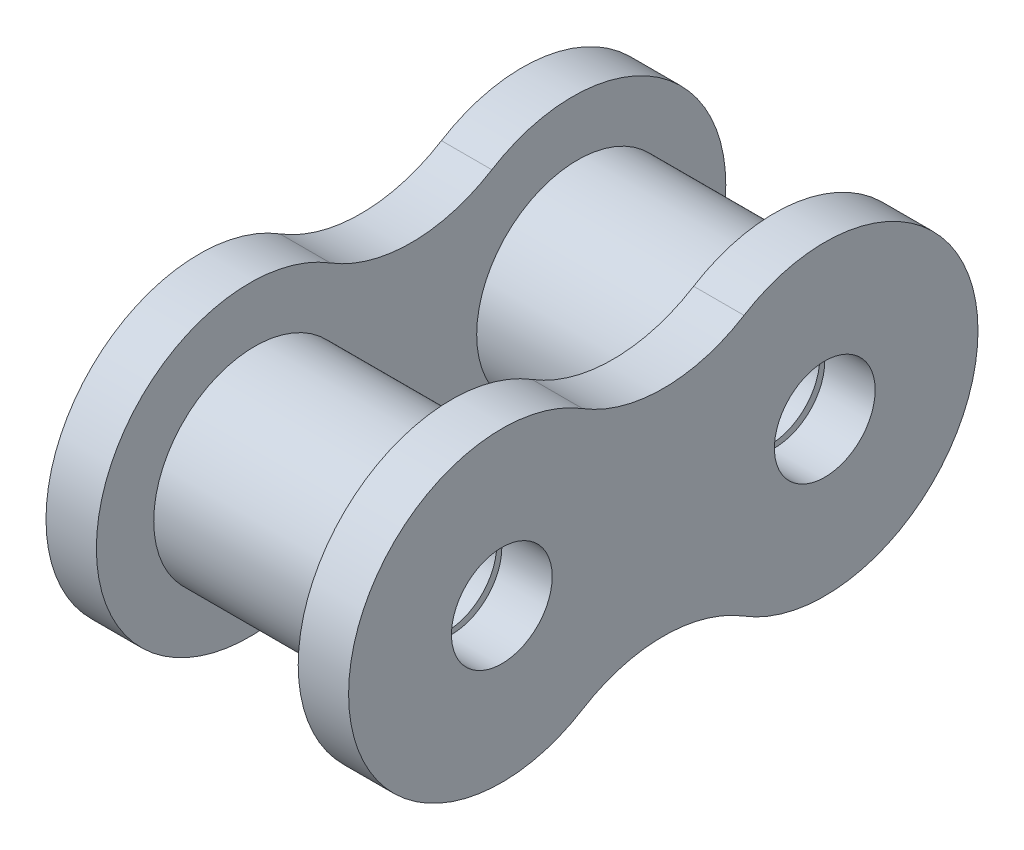
ISO-10303-21;
HEADER;
FILE_DESCRIPTION(('STEP AP214'),'2;1');
FILE_NAME('part.step','',(''),(''),'','','');
FILE_SCHEMA(('AUTOMOTIVE_DESIGN { 1 0 10303 214 1 1 1 1 }'));
ENDSEC;
DATA;
#1=APPLICATION_CONTEXT('core data for automotive mechanical design processes');
#2=APPLICATION_PROTOCOL_DEFINITION('international standard','automotive_design',2000,#1);
#3=PRODUCT_CONTEXT('',#1,'mechanical');
#4=PRODUCT('Part','Part','',(#3));
#5=PRODUCT_RELATED_PRODUCT_CATEGORY('part','',(#4));
#6=PRODUCT_DEFINITION_FORMATION('','',#4);
#7=PRODUCT_DEFINITION_CONTEXT('part definition',#1,'design');
#8=PRODUCT_DEFINITION('design','',#6,#7);
#9=PRODUCT_DEFINITION_SHAPE('','',#8);
#10=(LENGTH_UNIT() NAMED_UNIT(*) SI_UNIT(.MILLI.,.METRE.));
#11=(NAMED_UNIT(*) PLANE_ANGLE_UNIT() SI_UNIT($,.RADIAN.));
#12=(NAMED_UNIT(*) SI_UNIT($,.STERADIAN.) SOLID_ANGLE_UNIT());
#13=UNCERTAINTY_MEASURE_WITH_UNIT(LENGTH_MEASURE(1.E-05),#10,'distance_accuracy_value','');
#14=(GEOMETRIC_REPRESENTATION_CONTEXT(3) GLOBAL_UNCERTAINTY_ASSIGNED_CONTEXT((#13)) GLOBAL_UNIT_ASSIGNED_CONTEXT((#10,
#11,#12)) REPRESENTATION_CONTEXT('',''));
#15=CARTESIAN_POINT('',(0.,0.,0.));
#16=DIRECTION('',(0.,0.,1.));
#17=DIRECTION('',(1.,0.,0.));
#18=AXIS2_PLACEMENT_3D('',#15,#16,#17);
#19=CARTESIAN_POINT('',(-7.540625,0.,12.7));
#20=DIRECTION('',(1.,0.,0.));
#21=DIRECTION('',(0.,0.,-1.));
#22=AXIS2_PLACEMENT_3D('',#19,#20,#21);
#23=CYLINDRICAL_SURFACE('',#22,7.9375);
#24=CARTESIAN_POINT('',(-7.540625,0.,12.7));
#25=DIRECTION('',(1.,0.,0.));
#26=DIRECTION('',(0.,0.,-1.));
#27=AXIS2_PLACEMENT_3D('',#24,#25,#26);
#28=CIRCLE('',#27,7.9375);
#29=CARTESIAN_POINT('',(-7.540625,0.,4.7625));
#30=VERTEX_POINT('',#29);
#31=EDGE_CURVE('E11',#30,#30,#28,.T.);
#32=ORIENTED_EDGE('',*,*,#31,.T.);
#33=EDGE_LOOP('',(#32));
#34=FACE_BOUND('',#33,.T.);
#35=CARTESIAN_POINT('',(7.540625,0.,12.7));
#36=DIRECTION('',(1.,0.,0.));
#37=DIRECTION('',(0.,0.,-1.));
#38=AXIS2_PLACEMENT_3D('',#35,#36,#37);
#39=CIRCLE('',#38,7.9375);
#40=CARTESIAN_POINT('',(7.540625,0.,4.7625));
#41=VERTEX_POINT('',#40);
#42=EDGE_CURVE('E59',#41,#41,#39,.T.);
#43=ORIENTED_EDGE('',*,*,#42,.F.);
#44=EDGE_LOOP('',(#43));
#45=FACE_BOUND('',#44,.T.);
#46=ADVANCED_FACE('F49',(#34,#45),#23,.T.);
#47=CARTESIAN_POINT('',(-7.540625,0.,12.7));
#48=DIRECTION('',(1.,0.,0.));
#49=DIRECTION('',(0.,0.,-1.));
#50=AXIS2_PLACEMENT_3D('',#47,#48,#49);
#51=PLANE('',#50);
#52=CARTESIAN_POINT('',(-7.540625,0.,12.7));
#53=DIRECTION('',(1.,0.,0.));
#54=DIRECTION('',(0.,0.,-1.));
#55=AXIS2_PLACEMENT_3D('',#52,#53,#54);
#56=CIRCLE('',#55,3.9624);
#57=CARTESIAN_POINT('',(-7.540625,0.,8.7376));
#58=VERTEX_POINT('',#57);
#59=EDGE_CURVE('E55',#58,#58,#56,.T.);
#60=ORIENTED_EDGE('',*,*,#59,.T.);
#61=EDGE_LOOP('',(#60));
#62=FACE_BOUND('',#61,.T.);
#63=ORIENTED_EDGE('',*,*,#31,.F.);
#64=EDGE_LOOP('',(#63));
#65=FACE_BOUND('',#64,.T.);
#66=ADVANCED_FACE('F80',(#62,#65),#51,.F.);
#67=CARTESIAN_POINT('',(-7.540625,0.,12.7));
#68=DIRECTION('',(1.,0.,0.));
#69=DIRECTION('',(0.,0.,-1.));
#70=AXIS2_PLACEMENT_3D('',#67,#68,#69);
#71=CYLINDRICAL_SURFACE('',#70,3.9624);
#72=ORIENTED_EDGE('',*,*,#59,.F.);
#73=EDGE_LOOP('',(#72));
#74=FACE_BOUND('',#73,.T.);
#75=CARTESIAN_POINT('',(7.540625,0.,12.7));
#76=DIRECTION('',(1.,0.,0.));
#77=DIRECTION('',(0.,0.,-1.));
#78=AXIS2_PLACEMENT_3D('',#75,#76,#77);
#79=CIRCLE('',#78,3.9624);
#80=CARTESIAN_POINT('',(7.540625,0.,8.7376));
#81=VERTEX_POINT('',#80);
#82=EDGE_CURVE('E64',#81,#81,#79,.T.);
#83=ORIENTED_EDGE('',*,*,#82,.T.);
#84=EDGE_LOOP('',(#83));
#85=FACE_BOUND('',#84,.T.);
#86=ADVANCED_FACE('F71',(#74,#85),#71,.F.);
#87=CARTESIAN_POINT('',(7.540625,0.,12.7));
#88=DIRECTION('',(1.,0.,0.));
#89=DIRECTION('',(0.,0.,-1.));
#90=AXIS2_PLACEMENT_3D('',#87,#88,#89);
#91=PLANE('',#90);
#92=ORIENTED_EDGE('',*,*,#42,.T.);
#93=EDGE_LOOP('',(#92));
#94=FACE_BOUND('',#93,.T.);
#95=ORIENTED_EDGE('',*,*,#82,.F.);
#96=EDGE_LOOP('',(#95));
#97=FACE_BOUND('',#96,.T.);
#98=ADVANCED_FACE('F73',(#94,#97),#91,.T.);
#99=CLOSED_SHELL('',(#46,#66,#86,#98));
#100=MANIFOLD_SOLID_BREP('B2',#99);
#101=CARTESIAN_POINT('',(-7.540625,0.,-12.7));
#102=DIRECTION('',(1.,0.,0.));
#103=DIRECTION('',(0.,0.,-1.));
#104=AXIS2_PLACEMENT_3D('',#101,#102,#103);
#105=CYLINDRICAL_SURFACE('',#104,7.9375);
#106=CARTESIAN_POINT('',(-7.540625,0.,-12.7));
#107=DIRECTION('',(1.,0.,0.));
#108=DIRECTION('',(0.,0.,-1.));
#109=AXIS2_PLACEMENT_3D('',#106,#107,#108);
#110=CIRCLE('',#109,7.9375);
#111=CARTESIAN_POINT('',(-7.540625,0.,-20.6375));
#112=VERTEX_POINT('',#111);
#113=EDGE_CURVE('E48',#112,#112,#110,.T.);
#114=ORIENTED_EDGE('',*,*,#113,.T.);
#115=EDGE_LOOP('',(#114));
#116=FACE_BOUND('',#115,.T.);
#117=CARTESIAN_POINT('',(7.540625,0.,-12.7));
#118=DIRECTION('',(1.,0.,0.));
#119=DIRECTION('',(0.,0.,-1.));
#120=AXIS2_PLACEMENT_3D('',#117,#118,#119);
#121=CIRCLE('',#120,7.9375);
#122=CARTESIAN_POINT('',(7.540625,0.,-20.6375));
#123=VERTEX_POINT('',#122);
#124=EDGE_CURVE('E133',#123,#123,#121,.T.);
#125=ORIENTED_EDGE('',*,*,#124,.F.);
#126=EDGE_LOOP('',(#125));
#127=FACE_BOUND('',#126,.T.);
#128=ADVANCED_FACE('F122',(#116,#127),#105,.T.);
#129=CARTESIAN_POINT('',(-7.540625,0.,-12.7));
#130=DIRECTION('',(1.,0.,0.));
#131=DIRECTION('',(0.,0.,-1.));
#132=AXIS2_PLACEMENT_3D('',#129,#130,#131);
#133=PLANE('',#132);
#134=CARTESIAN_POINT('',(-7.540625,0.,-12.7));
#135=DIRECTION('',(1.,0.,0.));
#136=DIRECTION('',(0.,0.,-1.));
#137=AXIS2_PLACEMENT_3D('',#134,#135,#136);
#138=CIRCLE('',#137,3.9624);
#139=CARTESIAN_POINT('',(-7.540625,0.,-16.6624));
#140=VERTEX_POINT('',#139);
#141=EDGE_CURVE('E129',#140,#140,#138,.T.);
#142=ORIENTED_EDGE('',*,*,#141,.T.);
#143=EDGE_LOOP('',(#142));
#144=FACE_BOUND('',#143,.T.);
#145=ORIENTED_EDGE('',*,*,#113,.F.);
#146=EDGE_LOOP('',(#145));
#147=FACE_BOUND('',#146,.T.);
#148=ADVANCED_FACE('F152',(#144,#147),#133,.F.);
#149=CARTESIAN_POINT('',(-7.540625,0.,-12.7));
#150=DIRECTION('',(1.,0.,0.));
#151=DIRECTION('',(0.,0.,-1.));
#152=AXIS2_PLACEMENT_3D('',#149,#150,#151);
#153=CYLINDRICAL_SURFACE('',#152,3.9624);
#154=ORIENTED_EDGE('',*,*,#141,.F.);
#155=EDGE_LOOP('',(#154));
#156=FACE_BOUND('',#155,.T.);
#157=CARTESIAN_POINT('',(7.540625,0.,-12.7));
#158=DIRECTION('',(1.,0.,0.));
#159=DIRECTION('',(0.,0.,-1.));
#160=AXIS2_PLACEMENT_3D('',#157,#158,#159);
#161=CIRCLE('',#160,3.9624);
#162=CARTESIAN_POINT('',(7.540625,0.,-16.6624));
#163=VERTEX_POINT('',#162);
#164=EDGE_CURVE('E137',#163,#163,#161,.T.);
#165=ORIENTED_EDGE('',*,*,#164,.T.);
#166=EDGE_LOOP('',(#165));
#167=FACE_BOUND('',#166,.T.);
#168=ADVANCED_FACE('F143',(#156,#167),#153,.F.);
#169=CARTESIAN_POINT('',(7.540625,0.,-12.7));
#170=DIRECTION('',(1.,0.,0.));
#171=DIRECTION('',(0.,0.,-1.));
#172=AXIS2_PLACEMENT_3D('',#169,#170,#171);
#173=PLANE('',#172);
#174=ORIENTED_EDGE('',*,*,#124,.T.);
#175=EDGE_LOOP('',(#174));
#176=FACE_BOUND('',#175,.T.);
#177=ORIENTED_EDGE('',*,*,#164,.F.);
#178=EDGE_LOOP('',(#177));
#179=FACE_BOUND('',#178,.T.);
#180=ADVANCED_FACE('F145',(#176,#179),#173,.T.);
#181=CLOSED_SHELL('',(#128,#148,#168,#180));
#182=MANIFOLD_SOLID_BREP('B6',#181);
#183=CARTESIAN_POINT('',(11.8999,-10.2437998462485,6.35));
#184=DIRECTION('',(1.,0.,0.));
#185=DIRECTION('',(0.,0.,-1.));
#186=AXIS2_PLACEMENT_3D('',#183,#184,#185);
#187=PLANE('',#186);
#188=CARTESIAN_POINT('',(11.8999,0.,12.7));
#189=DIRECTION('',(1.,0.,0.));
#190=DIRECTION('',(0.,0.,-1.));
#191=AXIS2_PLACEMENT_3D('',#188,#189,#190);
#192=CIRCLE('',#191,3.9624);
#193=CARTESIAN_POINT('',(11.8999,0.,8.7376));
#194=VERTEX_POINT('',#193);
#195=EDGE_CURVE('E263',#194,#194,#192,.T.);
#196=ORIENTED_EDGE('',*,*,#195,.F.);
#197=EDGE_LOOP('',(#196));
#198=FACE_BOUND('',#197,.T.);
#199=CARTESIAN_POINT('',(11.8999,0.,12.7));
#200=DIRECTION('',(1.,0.,0.));
#201=DIRECTION('',(0.,0.,-1.));
#202=AXIS2_PLACEMENT_3D('',#199,#200,#201);
#203=CIRCLE('',#202,12.0523);
#204=CARTESIAN_POINT('',(11.8999,10.2437998462485,6.35000000000001));
#205=VERTEX_POINT('',#204);
#206=CARTESIAN_POINT('',(11.8999,-10.2437998462485,6.35));
#207=VERTEX_POINT('',#206);
#208=EDGE_CURVE('E247',#205,#207,#203,.T.);
#209=ORIENTED_EDGE('',*,*,#208,.T.);
#210=CARTESIAN_POINT('',(11.8999,-20.4875996924969,0.));
#211=DIRECTION('',(-1.,0.,0.));
#212=DIRECTION('',(0.,0.,-1.));
#213=AXIS2_PLACEMENT_3D('',#210,#211,#212);
#214=CIRCLE('',#213,12.0523);
#215=CARTESIAN_POINT('',(11.8999,-10.2437998462485,-6.34999999999999));
#216=VERTEX_POINT('',#215);
#217=EDGE_CURVE('E242',#207,#216,#214,.T.);
#218=ORIENTED_EDGE('',*,*,#217,.T.);
#219=CARTESIAN_POINT('',(11.8999,0.,-12.7));
#220=DIRECTION('',(1.,0.,0.));
#221=DIRECTION('',(0.,0.,-1.));
#222=AXIS2_PLACEMENT_3D('',#219,#220,#221);
#223=CIRCLE('',#222,12.0523);
#224=CARTESIAN_POINT('',(11.8999,10.2437998462484,-6.34999999999999));
#225=VERTEX_POINT('',#224);
#226=EDGE_CURVE('E245',#216,#225,#223,.T.);
#227=ORIENTED_EDGE('',*,*,#226,.T.);
#228=CARTESIAN_POINT('',(11.8999,20.4875996924969,0.));
#229=DIRECTION('',(-1.,0.,0.));
#230=DIRECTION('',(0.,0.,-1.));
#231=AXIS2_PLACEMENT_3D('',#228,#229,#230);
#232=CIRCLE('',#231,12.0523);
#233=EDGE_CURVE('E211',#225,#205,#232,.T.);
#234=ORIENTED_EDGE('',*,*,#233,.T.);
#235=EDGE_LOOP('',(#209,#218,#227,#234));
#236=FACE_BOUND('',#235,.T.);
#237=CARTESIAN_POINT('',(11.8999,0.,-12.7));
#238=DIRECTION('',(1.,0.,0.));
#239=DIRECTION('',(0.,0.,-1.));
#240=AXIS2_PLACEMENT_3D('',#237,#238,#239);
#241=CIRCLE('',#240,3.9624);
#242=CARTESIAN_POINT('',(11.8999,0.,-16.6624));
#243=VERTEX_POINT('',#242);
#244=EDGE_CURVE('E280',#243,#243,#241,.T.);
#245=ORIENTED_EDGE('',*,*,#244,.F.);
#246=EDGE_LOOP('',(#245));
#247=FACE_BOUND('',#246,.T.);
#248=ADVANCED_FACE('F193',(#198,#236,#247),#187,.T.);
#249=CARTESIAN_POINT('',(7.9375,-10.2437998462485,6.35));
#250=DIRECTION('',(1.,0.,0.));
#251=DIRECTION('',(0.,0.,-1.));
#252=AXIS2_PLACEMENT_3D('',#249,#250,#251);
#253=PLANE('',#252);
#254=CARTESIAN_POINT('',(7.9375,0.,12.7));
#255=DIRECTION('',(1.,0.,0.));
#256=DIRECTION('',(0.,0.,-1.));
#257=AXIS2_PLACEMENT_3D('',#254,#255,#256);
#258=CIRCLE('',#257,3.9624);
#259=CARTESIAN_POINT('',(7.9375,0.,8.7376));
#260=VERTEX_POINT('',#259);
#261=EDGE_CURVE('E276',#260,#260,#258,.T.);
#262=ORIENTED_EDGE('',*,*,#261,.T.);
#263=EDGE_LOOP('',(#262));
#264=FACE_BOUND('',#263,.T.);
#265=CARTESIAN_POINT('',(7.9375,0.,12.7));
#266=DIRECTION('',(1.,0.,0.));
#267=DIRECTION('',(0.,0.,-1.));
#268=AXIS2_PLACEMENT_3D('',#265,#266,#267);
#269=CIRCLE('',#268,12.0523);
#270=CARTESIAN_POINT('',(7.9375,10.2437998462485,6.35000000000001));
#271=VERTEX_POINT('',#270);
#272=CARTESIAN_POINT('',(7.9375,-10.2437998462485,6.35));
#273=VERTEX_POINT('',#272);
#274=EDGE_CURVE('E259',#271,#273,#269,.T.);
#275=ORIENTED_EDGE('',*,*,#274,.F.);
#276=CARTESIAN_POINT('',(7.9375,20.4875996924969,0.));
#277=DIRECTION('',(-1.,0.,0.));
#278=DIRECTION('',(0.,0.,-1.));
#279=AXIS2_PLACEMENT_3D('',#276,#277,#278);
#280=CIRCLE('',#279,12.0523);
#281=CARTESIAN_POINT('',(7.9375,10.2437998462484,-6.34999999999999));
#282=VERTEX_POINT('',#281);
#283=EDGE_CURVE('E235',#282,#271,#280,.T.);
#284=ORIENTED_EDGE('',*,*,#283,.F.);
#285=CARTESIAN_POINT('',(7.9375,0.,-12.7));
#286=DIRECTION('',(1.,0.,0.));
#287=DIRECTION('',(0.,0.,-1.));
#288=AXIS2_PLACEMENT_3D('',#285,#286,#287);
#289=CIRCLE('',#288,12.0523);
#290=CARTESIAN_POINT('',(7.9375,-10.2437998462485,-6.34999999999999));
#291=VERTEX_POINT('',#290);
#292=EDGE_CURVE('E229',#291,#282,#289,.T.);
#293=ORIENTED_EDGE('',*,*,#292,.F.);
#294=CARTESIAN_POINT('',(7.9375,-20.4875996924969,0.));
#295=DIRECTION('',(-1.,0.,0.));
#296=DIRECTION('',(0.,0.,-1.));
#297=AXIS2_PLACEMENT_3D('',#294,#295,#296);
#298=CIRCLE('',#297,12.0523);
#299=EDGE_CURVE('E251',#273,#291,#298,.T.);
#300=ORIENTED_EDGE('',*,*,#299,.F.);
#301=EDGE_LOOP('',(#275,#284,#293,#300));
#302=FACE_BOUND('',#301,.T.);
#303=CARTESIAN_POINT('',(7.9375,0.,-12.7));
#304=DIRECTION('',(1.,0.,0.));
#305=DIRECTION('',(0.,0.,-1.));
#306=AXIS2_PLACEMENT_3D('',#303,#304,#305);
#307=CIRCLE('',#306,3.9624);
#308=CARTESIAN_POINT('',(7.9375,0.,-16.6624));
#309=VERTEX_POINT('',#308);
#310=EDGE_CURVE('E284',#309,#309,#307,.T.);
#311=ORIENTED_EDGE('',*,*,#310,.T.);
#312=EDGE_LOOP('',(#311));
#313=FACE_BOUND('',#312,.T.);
#314=ADVANCED_FACE('F272',(#264,#302,#313),#253,.F.);
#315=CARTESIAN_POINT('',(11.8999,0.,12.7));
#316=DIRECTION('',(-1.,0.,0.));
#317=DIRECTION('',(0.,0.,1.));
#318=AXIS2_PLACEMENT_3D('',#315,#316,#317);
#319=CYLINDRICAL_SURFACE('',#318,12.0523);
#320=ORIENTED_EDGE('',*,*,#274,.T.);
#321=DIRECTION('',(-1.,0.,0.));
#322=VECTOR('',#321,1.);
#323=CARTESIAN_POINT('',(11.8999,-10.2437998462485,6.35));
#324=LINE('',#323,#322);
#325=EDGE_CURVE('E120',#207,#273,#324,.T.);
#326=ORIENTED_EDGE('',*,*,#325,.F.);
#327=ORIENTED_EDGE('',*,*,#208,.F.);
#328=DIRECTION('',(-1.,0.,0.));
#329=VECTOR('',#328,1.);
#330=CARTESIAN_POINT('',(11.8999,10.2437998462485,6.35000000000001));
#331=LINE('',#330,#329);
#332=EDGE_CURVE('E255',#205,#271,#331,.T.);
#333=ORIENTED_EDGE('',*,*,#332,.T.);
#334=EDGE_LOOP('',(#320,#326,#327,#333));
#335=FACE_BOUND('',#334,.T.);
#336=ADVANCED_FACE('F195',(#335),#319,.T.);
#337=CARTESIAN_POINT('',(11.8999,-20.4875996924969,0.));
#338=DIRECTION('',(-1.,0.,0.));
#339=DIRECTION('',(0.,0.,1.));
#340=AXIS2_PLACEMENT_3D('',#337,#338,#339);
#341=CYLINDRICAL_SURFACE('',#340,12.0523);
#342=ORIENTED_EDGE('',*,*,#299,.T.);
#343=DIRECTION('',(-1.,0.,0.));
#344=VECTOR('',#343,1.);
#345=CARTESIAN_POINT('',(11.8999,-10.2437998462485,-6.34999999999999));
#346=LINE('',#345,#344);
#347=EDGE_CURVE('E203',#216,#291,#346,.T.);
#348=ORIENTED_EDGE('',*,*,#347,.F.);
#349=ORIENTED_EDGE('',*,*,#217,.F.);
#350=ORIENTED_EDGE('',*,*,#325,.T.);
#351=EDGE_LOOP('',(#342,#348,#349,#350));
#352=FACE_BOUND('',#351,.T.);
#353=ADVANCED_FACE('F250',(#352),#341,.F.);
#354=CARTESIAN_POINT('',(11.8999,0.,-12.7));
#355=DIRECTION('',(-1.,0.,0.));
#356=DIRECTION('',(0.,0.,1.));
#357=AXIS2_PLACEMENT_3D('',#354,#355,#356);
#358=CYLINDRICAL_SURFACE('',#357,12.0523);
#359=ORIENTED_EDGE('',*,*,#292,.T.);
#360=DIRECTION('',(-1.,0.,0.));
#361=VECTOR('',#360,1.);
#362=CARTESIAN_POINT('',(11.8999,10.2437998462484,-6.34999999999999));
#363=LINE('',#362,#361);
#364=EDGE_CURVE('E252',#225,#282,#363,.T.);
#365=ORIENTED_EDGE('',*,*,#364,.F.);
#366=ORIENTED_EDGE('',*,*,#226,.F.);
#367=ORIENTED_EDGE('',*,*,#347,.T.);
#368=EDGE_LOOP('',(#359,#365,#366,#367));
#369=FACE_BOUND('',#368,.T.);
#370=ADVANCED_FACE('F253',(#369),#358,.T.);
#371=CARTESIAN_POINT('',(11.8999,20.4875996924969,0.));
#372=DIRECTION('',(-1.,0.,0.));
#373=DIRECTION('',(0.,0.,1.));
#374=AXIS2_PLACEMENT_3D('',#371,#372,#373);
#375=CYLINDRICAL_SURFACE('',#374,12.0523);
#376=ORIENTED_EDGE('',*,*,#283,.T.);
#377=ORIENTED_EDGE('',*,*,#332,.F.);
#378=ORIENTED_EDGE('',*,*,#233,.F.);
#379=ORIENTED_EDGE('',*,*,#364,.T.);
#380=EDGE_LOOP('',(#376,#377,#378,#379));
#381=FACE_BOUND('',#380,.T.);
#382=ADVANCED_FACE('F269',(#381),#375,.F.);
#383=CARTESIAN_POINT('',(11.8999,0.,12.7));
#384=DIRECTION('',(-1.,0.,0.));
#385=DIRECTION('',(0.,0.,1.));
#386=AXIS2_PLACEMENT_3D('',#383,#384,#385);
#387=CYLINDRICAL_SURFACE('',#386,3.9624);
#388=ORIENTED_EDGE('',*,*,#195,.T.);
#389=EDGE_LOOP('',(#388));
#390=FACE_BOUND('',#389,.T.);
#391=ORIENTED_EDGE('',*,*,#261,.F.);
#392=EDGE_LOOP('',(#391));
#393=FACE_BOUND('',#392,.T.);
#394=ADVANCED_FACE('F302',(#390,#393),#387,.F.);
#395=CARTESIAN_POINT('',(11.8999,0.,-12.7));
#396=DIRECTION('',(-1.,0.,0.));
#397=DIRECTION('',(0.,0.,1.));
#398=AXIS2_PLACEMENT_3D('',#395,#396,#397);
#399=CYLINDRICAL_SURFACE('',#398,3.9624);
#400=ORIENTED_EDGE('',*,*,#244,.T.);
#401=EDGE_LOOP('',(#400));
#402=FACE_BOUND('',#401,.T.);
#403=ORIENTED_EDGE('',*,*,#310,.F.);
#404=EDGE_LOOP('',(#403));
#405=FACE_BOUND('',#404,.T.);
#406=ADVANCED_FACE('F290',(#402,#405),#399,.F.);
#407=CLOSED_SHELL('',(#248,#314,#336,#353,#370,#382,#394,#406));
#408=MANIFOLD_SOLID_BREP('B43',#407);
#409=CARTESIAN_POINT('',(-11.8999,20.4875996924969,0.));
#410=DIRECTION('',(1.,0.,0.));
#411=DIRECTION('',(0.,0.,-1.));
#412=AXIS2_PLACEMENT_3D('',#409,#410,#411);
#413=CYLINDRICAL_SURFACE('',#412,12.0523);
#414=CARTESIAN_POINT('',(-7.9375,20.4875996924969,0.));
#415=DIRECTION('',(-1.,0.,0.));
#416=DIRECTION('',(0.,0.,1.));
#417=AXIS2_PLACEMENT_3D('',#414,#415,#416);
#418=CIRCLE('',#417,12.0523);
#419=CARTESIAN_POINT('',(-7.9375,10.2437998462484,-6.34999999999999));
#420=VERTEX_POINT('',#419);
#421=CARTESIAN_POINT('',(-7.9375,10.2437998462485,6.35));
#422=VERTEX_POINT('',#421);
#423=EDGE_CURVE('E433',#420,#422,#418,.T.);
#424=ORIENTED_EDGE('',*,*,#423,.F.);
#425=DIRECTION('',(1.,0.,0.));
#426=VECTOR('',#425,1.);
#427=CARTESIAN_POINT('',(-11.8999,10.2437998462484,-6.34999999999999));
#428=LINE('',#427,#426);
#429=CARTESIAN_POINT('',(-11.8999,10.2437998462484,-6.34999999999999));
#430=VERTEX_POINT('',#429);
#431=EDGE_CURVE('E191',#430,#420,#428,.T.);
#432=ORIENTED_EDGE('',*,*,#431,.F.);
#433=CARTESIAN_POINT('',(-11.8999,20.4875996924969,0.));
#434=DIRECTION('',(-1.,0.,0.));
#435=DIRECTION('',(0.,0.,1.));
#436=AXIS2_PLACEMENT_3D('',#433,#434,#435);
#437=CIRCLE('',#436,12.0523);
#438=CARTESIAN_POINT('',(-11.8999,10.2437998462485,6.35));
#439=VERTEX_POINT('',#438);
#440=EDGE_CURVE('E425',#430,#439,#437,.T.);
#441=ORIENTED_EDGE('',*,*,#440,.T.);
#442=DIRECTION('',(1.,0.,0.));
#443=VECTOR('',#442,1.);
#444=CARTESIAN_POINT('',(-11.8999,10.2437998462485,6.35));
#445=LINE('',#444,#443);
#446=EDGE_CURVE('E369',#439,#422,#445,.T.);
#447=ORIENTED_EDGE('',*,*,#446,.T.);
#448=EDGE_LOOP('',(#424,#432,#441,#447));
#449=FACE_BOUND('',#448,.T.);
#450=ADVANCED_FACE('F366',(#449),#413,.F.);
#451=CARTESIAN_POINT('',(-11.8999,0.,-12.7));
#452=DIRECTION('',(1.,0.,0.));
#453=DIRECTION('',(0.,0.,-1.));
#454=AXIS2_PLACEMENT_3D('',#451,#452,#453);
#455=CYLINDRICAL_SURFACE('',#454,12.0523);
#456=CARTESIAN_POINT('',(-7.9375,0.,-12.7));
#457=DIRECTION('',(1.,0.,0.));
#458=DIRECTION('',(0.,0.,-1.));
#459=AXIS2_PLACEMENT_3D('',#456,#457,#458);
#460=CIRCLE('',#459,12.0523);
#461=CARTESIAN_POINT('',(-7.9375,-10.2437998462485,-6.35));
#462=VERTEX_POINT('',#461);
#463=EDGE_CURVE('E427',#462,#420,#460,.T.);
#464=ORIENTED_EDGE('',*,*,#463,.F.);
#465=DIRECTION('',(1.,0.,0.));
#466=VECTOR('',#465,1.);
#467=CARTESIAN_POINT('',(-11.8999,-10.2437998462485,-6.35));
#468=LINE('',#467,#466);
#469=CARTESIAN_POINT('',(-11.8999,-10.2437998462485,-6.35));
#470=VERTEX_POINT('',#469);
#471=EDGE_CURVE('E375',#470,#462,#468,.T.);
#472=ORIENTED_EDGE('',*,*,#471,.F.);
#473=CARTESIAN_POINT('',(-11.8999,0.,-12.7));
#474=DIRECTION('',(1.,0.,0.));
#475=DIRECTION('',(0.,0.,-1.));
#476=AXIS2_PLACEMENT_3D('',#473,#474,#475);
#477=CIRCLE('',#476,12.0523);
#478=EDGE_CURVE('E422',#470,#430,#477,.T.);
#479=ORIENTED_EDGE('',*,*,#478,.T.);
#480=ORIENTED_EDGE('',*,*,#431,.T.);
#481=EDGE_LOOP('',(#464,#472,#479,#480));
#482=FACE_BOUND('',#481,.T.);
#483=ADVANCED_FACE('F447',(#482),#455,.T.);
#484=CARTESIAN_POINT('',(-11.8999,-20.4875996924969,0.));
#485=DIRECTION('',(1.,0.,0.));
#486=DIRECTION('',(0.,0.,-1.));
#487=AXIS2_PLACEMENT_3D('',#484,#485,#486);
#488=CYLINDRICAL_SURFACE('',#487,12.0523);
#489=CARTESIAN_POINT('',(-7.9375,-20.4875996924969,0.));
#490=DIRECTION('',(-1.,0.,0.));
#491=DIRECTION('',(0.,0.,1.));
#492=AXIS2_PLACEMENT_3D('',#489,#490,#491);
#493=CIRCLE('',#492,12.0523);
#494=CARTESIAN_POINT('',(-7.9375,-10.2437998462485,6.35));
#495=VERTEX_POINT('',#494);
#496=EDGE_CURVE('E417',#495,#462,#493,.T.);
#497=ORIENTED_EDGE('',*,*,#496,.F.);
#498=DIRECTION('',(1.,0.,0.));
#499=VECTOR('',#498,1.);
#500=CARTESIAN_POINT('',(-11.8999,-10.2437998462485,6.35));
#501=LINE('',#500,#499);
#502=CARTESIAN_POINT('',(-11.8999,-10.2437998462485,6.35));
#503=VERTEX_POINT('',#502);
#504=EDGE_CURVE('E412',#503,#495,#501,.T.);
#505=ORIENTED_EDGE('',*,*,#504,.F.);
#506=CARTESIAN_POINT('',(-11.8999,-20.4875996924969,0.));
#507=DIRECTION('',(-1.,0.,0.));
#508=DIRECTION('',(0.,0.,1.));
#509=AXIS2_PLACEMENT_3D('',#506,#507,#508);
#510=CIRCLE('',#509,12.0523);
#511=EDGE_CURVE('E415',#503,#470,#510,.T.);
#512=ORIENTED_EDGE('',*,*,#511,.T.);
#513=ORIENTED_EDGE('',*,*,#471,.T.);
#514=EDGE_LOOP('',(#497,#505,#512,#513));
#515=FACE_BOUND('',#514,.T.);
#516=ADVANCED_FACE('F414',(#515),#488,.F.);
#517=CARTESIAN_POINT('',(-11.8999,0.,12.7));
#518=DIRECTION('',(1.,0.,0.));
#519=DIRECTION('',(0.,0.,-1.));
#520=AXIS2_PLACEMENT_3D('',#517,#518,#519);
#521=CYLINDRICAL_SURFACE('',#520,12.0523);
#522=CARTESIAN_POINT('',(-7.9375,0.,12.7));
#523=DIRECTION('',(1.,0.,0.));
#524=DIRECTION('',(0.,0.,-1.));
#525=AXIS2_PLACEMENT_3D('',#522,#523,#524);
#526=CIRCLE('',#525,12.0523);
#527=EDGE_CURVE('E436',#422,#495,#526,.T.);
#528=ORIENTED_EDGE('',*,*,#527,.F.);
#529=ORIENTED_EDGE('',*,*,#446,.F.);
#530=CARTESIAN_POINT('',(-11.8999,0.,12.7));
#531=DIRECTION('',(1.,0.,0.));
#532=DIRECTION('',(0.,0.,-1.));
#533=AXIS2_PLACEMENT_3D('',#530,#531,#532);
#534=CIRCLE('',#533,12.0523);
#535=EDGE_CURVE('E421',#439,#503,#534,.T.);
#536=ORIENTED_EDGE('',*,*,#535,.T.);
#537=ORIENTED_EDGE('',*,*,#504,.T.);
#538=EDGE_LOOP('',(#528,#529,#536,#537));
#539=FACE_BOUND('',#538,.T.);
#540=ADVANCED_FACE('F424',(#539),#521,.T.);
#541=CARTESIAN_POINT('',(-11.8999,10.2437998462485,6.35));
#542=DIRECTION('',(-1.,0.,0.));
#543=DIRECTION('',(0.,0.,1.));
#544=AXIS2_PLACEMENT_3D('',#541,#542,#543);
#545=PLANE('',#544);
#546=CARTESIAN_POINT('',(-11.8999,0.,-12.7));
#547=DIRECTION('',(1.,0.,0.));
#548=DIRECTION('',(0.,0.,-1.));
#549=AXIS2_PLACEMENT_3D('',#546,#547,#548);
#550=CIRCLE('',#549,3.9624);
#551=CARTESIAN_POINT('',(-11.8999,0.,-16.6624));
#552=VERTEX_POINT('',#551);
#553=EDGE_CURVE('E480',#552,#552,#550,.T.);
#554=ORIENTED_EDGE('',*,*,#553,.T.);
#555=EDGE_LOOP('',(#554));
#556=FACE_BOUND('',#555,.T.);
#557=CARTESIAN_POINT('',(-11.8999,0.,12.7));
#558=DIRECTION('',(1.,0.,0.));
#559=DIRECTION('',(0.,0.,-1.));
#560=AXIS2_PLACEMENT_3D('',#557,#558,#559);
#561=CIRCLE('',#560,3.9624);
#562=CARTESIAN_POINT('',(-11.8999,0.,8.7376));
#563=VERTEX_POINT('',#562);
#564=EDGE_CURVE('E437',#563,#563,#561,.T.);
#565=ORIENTED_EDGE('',*,*,#564,.T.);
#566=EDGE_LOOP('',(#565));
#567=FACE_BOUND('',#566,.T.);
#568=ORIENTED_EDGE('',*,*,#440,.F.);
#569=ORIENTED_EDGE('',*,*,#478,.F.);
#570=ORIENTED_EDGE('',*,*,#511,.F.);
#571=ORIENTED_EDGE('',*,*,#535,.F.);
#572=EDGE_LOOP('',(#568,#569,#570,#571));
#573=FACE_BOUND('',#572,.T.);
#574=ADVANCED_FACE('F420',(#556,#567,#573),#545,.T.);
#575=CARTESIAN_POINT('',(-7.9375,10.2437998462485,6.35));
#576=DIRECTION('',(-1.,0.,0.));
#577=DIRECTION('',(0.,0.,1.));
#578=AXIS2_PLACEMENT_3D('',#575,#576,#577);
#579=PLANE('',#578);
#580=CARTESIAN_POINT('',(-7.9375,0.,-12.7));
#581=DIRECTION('',(1.,0.,0.));
#582=DIRECTION('',(0.,0.,-1.));
#583=AXIS2_PLACEMENT_3D('',#580,#581,#582);
#584=CIRCLE('',#583,3.9624);
#585=CARTESIAN_POINT('',(-7.9375,0.,-16.6624));
#586=VERTEX_POINT('',#585);
#587=EDGE_CURVE('E483',#586,#586,#584,.T.);
#588=ORIENTED_EDGE('',*,*,#587,.F.);
#589=EDGE_LOOP('',(#588));
#590=FACE_BOUND('',#589,.T.);
#591=CARTESIAN_POINT('',(-7.9375,0.,12.7));
#592=DIRECTION('',(1.,0.,0.));
#593=DIRECTION('',(0.,0.,-1.));
#594=AXIS2_PLACEMENT_3D('',#591,#592,#593);
#595=CIRCLE('',#594,3.9624);
#596=CARTESIAN_POINT('',(-7.9375,0.,8.7376));
#597=VERTEX_POINT('',#596);
#598=EDGE_CURVE('E485',#597,#597,#595,.T.);
#599=ORIENTED_EDGE('',*,*,#598,.F.);
#600=EDGE_LOOP('',(#599));
#601=FACE_BOUND('',#600,.T.);
#602=ORIENTED_EDGE('',*,*,#423,.T.);
#603=ORIENTED_EDGE('',*,*,#527,.T.);
#604=ORIENTED_EDGE('',*,*,#496,.T.);
#605=ORIENTED_EDGE('',*,*,#463,.T.);
#606=EDGE_LOOP('',(#602,#603,#604,#605));
#607=FACE_BOUND('',#606,.T.);
#608=ADVANCED_FACE('F446',(#590,#601,#607),#579,.F.);
#609=CARTESIAN_POINT('',(-11.8999,0.,12.7));
#610=DIRECTION('',(1.,0.,0.));
#611=DIRECTION('',(0.,0.,-1.));
#612=AXIS2_PLACEMENT_3D('',#609,#610,#611);
#613=CYLINDRICAL_SURFACE('',#612,3.9624);
#614=ORIENTED_EDGE('',*,*,#564,.F.);
#615=EDGE_LOOP('',(#614));
#616=FACE_BOUND('',#615,.T.);
#617=ORIENTED_EDGE('',*,*,#598,.T.);
#618=EDGE_LOOP('',(#617));
#619=FACE_BOUND('',#618,.T.);
#620=ADVANCED_FACE('F465',(#616,#619),#613,.F.);
#621=CARTESIAN_POINT('',(-11.8999,0.,-12.7));
#622=DIRECTION('',(1.,0.,0.));
#623=DIRECTION('',(0.,0.,-1.));
#624=AXIS2_PLACEMENT_3D('',#621,#622,#623);
#625=CYLINDRICAL_SURFACE('',#624,3.9624);
#626=ORIENTED_EDGE('',*,*,#553,.F.);
#627=EDGE_LOOP('',(#626));
#628=FACE_BOUND('',#627,.T.);
#629=ORIENTED_EDGE('',*,*,#587,.T.);
#630=EDGE_LOOP('',(#629));
#631=FACE_BOUND('',#630,.T.);
#632=ADVANCED_FACE('F472',(#628,#631),#625,.F.);
#633=CLOSED_SHELL('',(#450,#483,#516,#540,#574,#608,#620,#632));
#634=MANIFOLD_SOLID_BREP('B114',#633);
#635=ADVANCED_BREP_SHAPE_REPRESENTATION('',(#18,#100,#182,#408,#634),#14);
#636=SHAPE_DEFINITION_REPRESENTATION(#9,#635);
ENDSEC;
END-ISO-10303-21;
